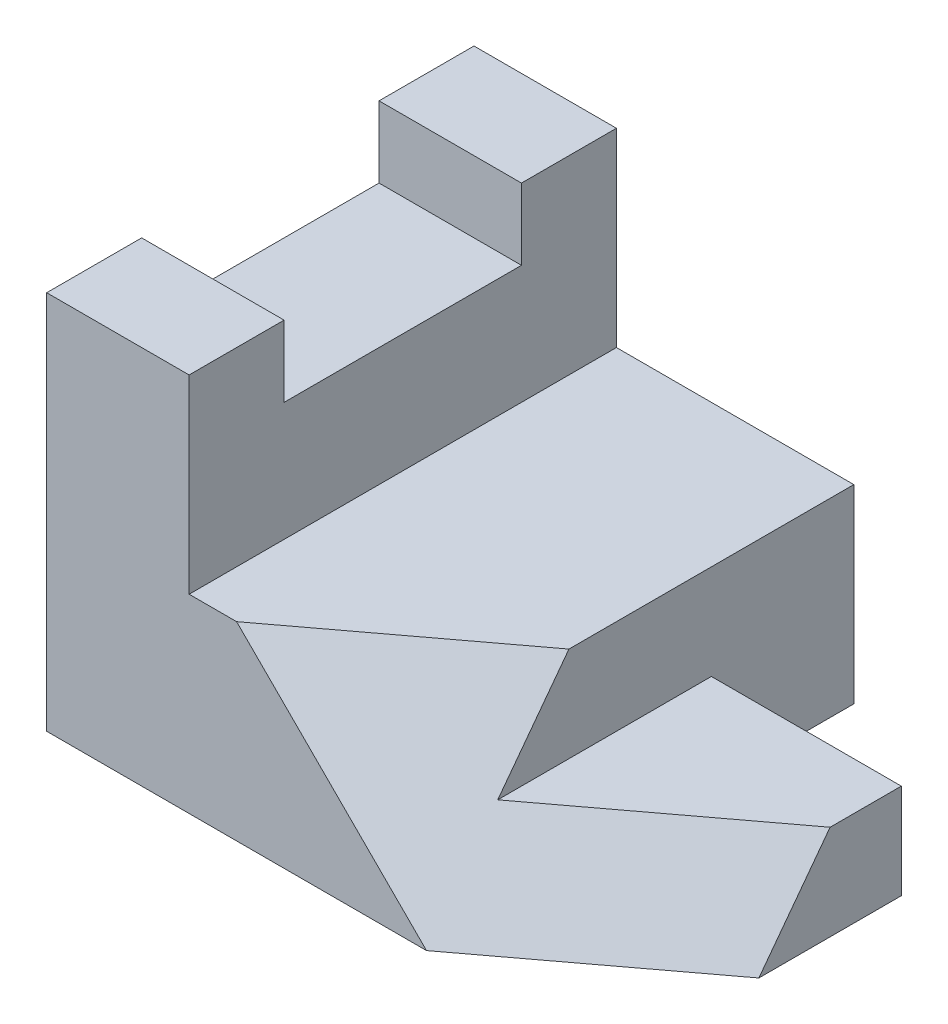
ISO-10303-21;
HEADER;
FILE_DESCRIPTION(('STEP AP214'),'2;1');
FILE_NAME('part.step','',(''),(''),'','','');
FILE_SCHEMA(('AUTOMOTIVE_DESIGN { 1 0 10303 214 1 1 1 1 }'));
ENDSEC;
DATA;
#1=APPLICATION_CONTEXT('core data for automotive mechanical design processes');
#2=APPLICATION_PROTOCOL_DEFINITION('international standard','automotive_design',2000,#1);
#3=PRODUCT_CONTEXT('',#1,'mechanical');
#4=PRODUCT('Part','Part','',(#3));
#5=PRODUCT_RELATED_PRODUCT_CATEGORY('part','',(#4));
#6=PRODUCT_DEFINITION_FORMATION('','',#4);
#7=PRODUCT_DEFINITION_CONTEXT('part definition',#1,'design');
#8=PRODUCT_DEFINITION('design','',#6,#7);
#9=PRODUCT_DEFINITION_SHAPE('','',#8);
#10=(LENGTH_UNIT() NAMED_UNIT(*) SI_UNIT(.MILLI.,.METRE.));
#11=(NAMED_UNIT(*) PLANE_ANGLE_UNIT() SI_UNIT($,.RADIAN.));
#12=(NAMED_UNIT(*) SI_UNIT($,.STERADIAN.) SOLID_ANGLE_UNIT());
#13=UNCERTAINTY_MEASURE_WITH_UNIT(LENGTH_MEASURE(1.E-05),#10,'distance_accuracy_value','');
#14=(GEOMETRIC_REPRESENTATION_CONTEXT(3) GLOBAL_UNCERTAINTY_ASSIGNED_CONTEXT((#13)) GLOBAL_UNIT_ASSIGNED_CONTEXT((#10,
#11,#12)) REPRESENTATION_CONTEXT('',''));
#15=CARTESIAN_POINT('',(0.,0.,0.));
#16=DIRECTION('',(0.,0.,1.));
#17=DIRECTION('',(1.,0.,0.));
#18=AXIS2_PLACEMENT_3D('',#15,#16,#17);
#19=CARTESIAN_POINT('',(0.,0.,0.));
#20=DIRECTION('',(-1.,0.,0.));
#21=DIRECTION('',(0.,0.,1.));
#22=AXIS2_PLACEMENT_3D('',#19,#20,#21);
#23=PLANE('',#22);
#24=DIRECTION('',(0.,0.,-1.));
#25=VECTOR('',#24,1.);
#26=CARTESIAN_POINT('',(0.,12.7,19.05));
#27=LINE('',#26,#25);
#28=CARTESIAN_POINT('',(0.,12.7,28.575));
#29=VERTEX_POINT('',#28);
#30=CARTESIAN_POINT('',(0.,12.7,19.05));
#31=VERTEX_POINT('',#30);
#32=EDGE_CURVE('E132',#29,#31,#27,.T.);
#33=ORIENTED_EDGE('',*,*,#32,.F.);
#34=DIRECTION('',(0.,0.8,-0.6));
#35=VECTOR('',#34,1.);
#36=CARTESIAN_POINT('',(0.,18.288,24.384));
#37=LINE('',#36,#35);
#38=CARTESIAN_POINT('',(0.,0.,38.1));
#39=VERTEX_POINT('',#38);
#40=EDGE_CURVE('E178',#39,#29,#37,.T.);
#41=ORIENTED_EDGE('',*,*,#40,.F.);
#42=DIRECTION('',(0.,0.,-1.));
#43=VECTOR('',#42,1.);
#44=CARTESIAN_POINT('',(0.,0.,57.15));
#45=LINE('',#44,#43);
#46=CARTESIAN_POINT('',(0.,0.,19.05));
#47=VERTEX_POINT('',#46);
#48=EDGE_CURVE('E151',#39,#47,#45,.T.);
#49=ORIENTED_EDGE('',*,*,#48,.T.);
#50=DIRECTION('',(0.,1.,0.));
#51=VECTOR('',#50,1.);
#52=CARTESIAN_POINT('',(0.,0.,19.05));
#53=LINE('',#52,#51);
#54=EDGE_CURVE('E145',#47,#31,#53,.T.);
#55=ORIENTED_EDGE('',*,*,#54,.T.);
#56=EDGE_LOOP('',(#33,#41,#49,#55));
#57=FACE_BOUND('',#56,.T.);
#58=ADVANCED_FACE('F33',(#57),#23,.F.);
#59=CARTESIAN_POINT('',(0.,0.,19.05));
#60=DIRECTION('',(0.,0.,1.));
#61=DIRECTION('',(1.,0.,0.));
#62=AXIS2_PLACEMENT_3D('',#59,#60,#61);
#63=PLANE('',#62);
#64=DIRECTION('',(-1.,0.,0.));
#65=VECTOR('',#64,1.);
#66=CARTESIAN_POINT('',(-25.4,12.7,19.05));
#67=LINE('',#66,#65);
#68=CARTESIAN_POINT('',(-25.4,12.7,19.05));
#69=VERTEX_POINT('',#68);
#70=EDGE_CURVE('E135',#31,#69,#67,.T.);
#71=ORIENTED_EDGE('',*,*,#70,.F.);
#72=ORIENTED_EDGE('',*,*,#54,.F.);
#73=DIRECTION('',(1.,0.,0.));
#74=VECTOR('',#73,1.);
#75=CARTESIAN_POINT('',(0.,0.,19.05));
#76=LINE('',#75,#74);
#77=CARTESIAN_POINT('',(-25.4,0.,19.05));
#78=VERTEX_POINT('',#77);
#79=EDGE_CURVE('E162',#78,#47,#76,.T.);
#80=ORIENTED_EDGE('',*,*,#79,.F.);
#81=DIRECTION('',(0.,1.,0.));
#82=VECTOR('',#81,1.);
#83=CARTESIAN_POINT('',(-25.4,0.,19.05));
#84=LINE('',#83,#82);
#85=EDGE_CURVE('E147',#78,#69,#84,.T.);
#86=ORIENTED_EDGE('',*,*,#85,.T.);
#87=EDGE_LOOP('',(#71,#72,#80,#86));
#88=FACE_BOUND('',#87,.T.);
#89=ADVANCED_FACE('F143',(#88),#63,.F.);
#90=CARTESIAN_POINT('',(-57.15,0.,57.15));
#91=DIRECTION('',(0.,0.,1.));
#92=DIRECTION('',(1.,0.,0.));
#93=AXIS2_PLACEMENT_3D('',#90,#91,#92);
#94=PLANE('',#93);
#95=DIRECTION('',(1.,0.,0.));
#96=VECTOR('',#95,1.);
#97=CARTESIAN_POINT('',(-57.15,0.,57.15));
#98=LINE('',#97,#96);
#99=CARTESIAN_POINT('',(-76.2,0.,57.15));
#100=VERTEX_POINT('',#99);
#101=CARTESIAN_POINT('',(-25.4,0.,57.15));
#102=VERTEX_POINT('',#101);
#103=EDGE_CURVE('E169',#100,#102,#98,.T.);
#104=ORIENTED_EDGE('',*,*,#103,.T.);
#105=DIRECTION('',(-0.707106781186548,0.707106781186548,0.));
#106=VECTOR('',#105,1.);
#107=CARTESIAN_POINT('',(-12.7,-12.7,57.15));
#108=LINE('',#107,#106);
#109=CARTESIAN_POINT('',(-50.8,25.4,57.15));
#110=VERTEX_POINT('',#109);
#111=EDGE_CURVE('E222',#102,#110,#108,.T.);
#112=ORIENTED_EDGE('',*,*,#111,.T.);
#113=DIRECTION('',(1.,0.,0.));
#114=VECTOR('',#113,1.);
#115=CARTESIAN_POINT('',(-57.15,25.4,57.15));
#116=LINE('',#115,#114);
#117=CARTESIAN_POINT('',(-57.15,25.4,57.15));
#118=VERTEX_POINT('',#117);
#119=EDGE_CURVE('E175',#118,#110,#116,.T.);
#120=ORIENTED_EDGE('',*,*,#119,.F.);
#121=DIRECTION('',(0.,1.,0.));
#122=VECTOR('',#121,1.);
#123=CARTESIAN_POINT('',(-57.15,0.,57.15));
#124=LINE('',#123,#122);
#125=CARTESIAN_POINT('',(-57.15,50.8,57.15));
#126=VERTEX_POINT('',#125);
#127=EDGE_CURVE('E148',#118,#126,#124,.T.);
#128=ORIENTED_EDGE('',*,*,#127,.T.);
#129=DIRECTION('',(1.,0.,0.));
#130=VECTOR('',#129,1.);
#131=CARTESIAN_POINT('',(-76.2,50.8,57.15));
#132=LINE('',#131,#130);
#133=CARTESIAN_POINT('',(-76.2,50.8,57.15));
#134=VERTEX_POINT('',#133);
#135=EDGE_CURVE('E225',#134,#126,#132,.T.);
#136=ORIENTED_EDGE('',*,*,#135,.F.);
#137=DIRECTION('',(0.,1.,0.));
#138=VECTOR('',#137,1.);
#139=CARTESIAN_POINT('',(-76.2,0.,57.15));
#140=LINE('',#139,#138);
#141=EDGE_CURVE('E233',#100,#134,#140,.T.);
#142=ORIENTED_EDGE('',*,*,#141,.F.);
#143=EDGE_LOOP('',(#104,#112,#120,#128,#136,#142));
#144=FACE_BOUND('',#143,.T.);
#145=ADVANCED_FACE('F35',(#144),#94,.T.);
#146=CARTESIAN_POINT('',(-57.15,25.4,57.15));
#147=DIRECTION('',(0.,1.,0.));
#148=DIRECTION('',(0.,0.,1.));
#149=AXIS2_PLACEMENT_3D('',#146,#147,#148);
#150=PLANE('',#149);
#151=DIRECTION('',(-0.8,0.,0.6));
#152=VECTOR('',#151,1.);
#153=CARTESIAN_POINT('',(9.14400000000001,25.4,12.192));
#154=LINE('',#153,#152);
#155=CARTESIAN_POINT('',(-25.4,25.4,38.1));
#156=VERTEX_POINT('',#155);
#157=EDGE_CURVE('E226',#156,#110,#154,.T.);
#158=ORIENTED_EDGE('',*,*,#157,.F.);
#159=DIRECTION('',(0.,0.,1.));
#160=VECTOR('',#159,1.);
#161=CARTESIAN_POINT('',(-25.4,25.4,0.));
#162=LINE('',#161,#160);
#163=CARTESIAN_POINT('',(-25.4,25.4,0.));
#164=VERTEX_POINT('',#163);
#165=EDGE_CURVE('E158',#164,#156,#162,.T.);
#166=ORIENTED_EDGE('',*,*,#165,.F.);
#167=DIRECTION('',(1.,0.,0.));
#168=VECTOR('',#167,1.);
#169=CARTESIAN_POINT('',(-57.15,25.4,0.));
#170=LINE('',#169,#168);
#171=CARTESIAN_POINT('',(-57.15,25.4,0.));
#172=VERTEX_POINT('',#171);
#173=EDGE_CURVE('E172',#172,#164,#170,.T.);
#174=ORIENTED_EDGE('',*,*,#173,.F.);
#175=DIRECTION('',(0.,0.,1.));
#176=VECTOR('',#175,1.);
#177=CARTESIAN_POINT('',(-57.15,25.4,57.15));
#178=LINE('',#177,#176);
#179=EDGE_CURVE('E153',#172,#118,#178,.T.);
#180=ORIENTED_EDGE('',*,*,#179,.T.);
#181=ORIENTED_EDGE('',*,*,#119,.T.);
#182=EDGE_LOOP('',(#158,#166,#174,#180,#181));
#183=FACE_BOUND('',#182,.T.);
#184=ADVANCED_FACE('F308',(#183),#150,.T.);
#185=CARTESIAN_POINT('',(-57.15,0.,57.15));
#186=DIRECTION('',(0.,-1.,0.));
#187=DIRECTION('',(0.,0.,-1.));
#188=AXIS2_PLACEMENT_3D('',#185,#186,#187);
#189=PLANE('',#188);
#190=ORIENTED_EDGE('',*,*,#48,.F.);
#191=DIRECTION('',(-0.8,0.,0.6));
#192=VECTOR('',#191,1.);
#193=CARTESIAN_POINT('',(34.544,0.,12.192));
#194=LINE('',#193,#192);
#195=EDGE_CURVE('E55',#39,#102,#194,.T.);
#196=ORIENTED_EDGE('',*,*,#195,.T.);
#197=ORIENTED_EDGE('',*,*,#103,.F.);
#198=DIRECTION('',(0.,0.,1.));
#199=VECTOR('',#198,1.);
#200=CARTESIAN_POINT('',(-76.2,0.,0.));
#201=LINE('',#200,#199);
#202=CARTESIAN_POINT('',(-76.2,0.,0.));
#203=VERTEX_POINT('',#202);
#204=EDGE_CURVE('E191',#203,#100,#201,.T.);
#205=ORIENTED_EDGE('',*,*,#204,.F.);
#206=DIRECTION('',(1.,0.,0.));
#207=VECTOR('',#206,1.);
#208=CARTESIAN_POINT('',(-57.15,0.,0.));
#209=LINE('',#208,#207);
#210=CARTESIAN_POINT('',(-25.4,0.,0.));
#211=VERTEX_POINT('',#210);
#212=EDGE_CURVE('E176',#203,#211,#209,.T.);
#213=ORIENTED_EDGE('',*,*,#212,.T.);
#214=DIRECTION('',(0.,0.,1.));
#215=VECTOR('',#214,1.);
#216=CARTESIAN_POINT('',(-25.4,0.,0.));
#217=LINE('',#216,#215);
#218=EDGE_CURVE('E189',#211,#78,#217,.T.);
#219=ORIENTED_EDGE('',*,*,#218,.T.);
#220=ORIENTED_EDGE('',*,*,#79,.T.);
#221=EDGE_LOOP('',(#190,#196,#197,#205,#213,#219,#220));
#222=FACE_BOUND('',#221,.T.);
#223=ADVANCED_FACE('F188',(#222),#189,.T.);
#224=CARTESIAN_POINT('',(-57.15,0.,0.));
#225=DIRECTION('',(0.,0.,-1.));
#226=DIRECTION('',(-1.,0.,0.));
#227=AXIS2_PLACEMENT_3D('',#224,#225,#226);
#228=PLANE('',#227);
#229=DIRECTION('',(0.,1.,0.));
#230=VECTOR('',#229,1.);
#231=CARTESIAN_POINT('',(-25.4,0.,0.));
#232=LINE('',#231,#230);
#233=EDGE_CURVE('E155',#211,#164,#232,.T.);
#234=ORIENTED_EDGE('',*,*,#233,.F.);
#235=ORIENTED_EDGE('',*,*,#212,.F.);
#236=DIRECTION('',(0.,-1.,0.));
#237=VECTOR('',#236,1.);
#238=CARTESIAN_POINT('',(-76.2,0.,0.));
#239=LINE('',#238,#237);
#240=CARTESIAN_POINT('',(-76.2,50.8,0.));
#241=VERTEX_POINT('',#240);
#242=EDGE_CURVE('E198',#241,#203,#239,.T.);
#243=ORIENTED_EDGE('',*,*,#242,.F.);
#244=DIRECTION('',(1.,0.,0.));
#245=VECTOR('',#244,1.);
#246=CARTESIAN_POINT('',(-76.2,50.8,0.));
#247=LINE('',#246,#245);
#248=CARTESIAN_POINT('',(-57.15,50.8,0.));
#249=VERTEX_POINT('',#248);
#250=EDGE_CURVE('E204',#241,#249,#247,.T.);
#251=ORIENTED_EDGE('',*,*,#250,.T.);
#252=DIRECTION('',(0.,-1.,0.));
#253=VECTOR('',#252,1.);
#254=CARTESIAN_POINT('',(-57.15,0.,0.));
#255=LINE('',#254,#253);
#256=EDGE_CURVE('E219',#249,#172,#255,.T.);
#257=ORIENTED_EDGE('',*,*,#256,.T.);
#258=ORIENTED_EDGE('',*,*,#173,.T.);
#259=EDGE_LOOP('',(#234,#235,#243,#251,#257,#258));
#260=FACE_BOUND('',#259,.T.);
#261=ADVANCED_FACE('F196',(#260),#228,.T.);
#262=CARTESIAN_POINT('',(-25.4,0.,0.));
#263=DIRECTION('',(-1.,0.,0.));
#264=DIRECTION('',(0.,0.,1.));
#265=AXIS2_PLACEMENT_3D('',#262,#263,#264);
#266=PLANE('',#265);
#267=ORIENTED_EDGE('',*,*,#165,.T.);
#268=DIRECTION('',(0.,-0.8,0.6));
#269=VECTOR('',#268,1.);
#270=CARTESIAN_POINT('',(-25.4,13.45184,47.06112));
#271=LINE('',#270,#269);
#272=CARTESIAN_POINT('',(-25.4,12.7,47.625));
#273=VERTEX_POINT('',#272);
#274=EDGE_CURVE('E11',#156,#273,#271,.T.);
#275=ORIENTED_EDGE('',*,*,#274,.T.);
#276=DIRECTION('',(0.,0.,1.));
#277=VECTOR('',#276,1.);
#278=CARTESIAN_POINT('',(-25.4,12.7,19.05));
#279=LINE('',#278,#277);
#280=EDGE_CURVE('E48',#69,#273,#279,.T.);
#281=ORIENTED_EDGE('',*,*,#280,.F.);
#282=ORIENTED_EDGE('',*,*,#85,.F.);
#283=ORIENTED_EDGE('',*,*,#218,.F.);
#284=ORIENTED_EDGE('',*,*,#233,.T.);
#285=EDGE_LOOP('',(#267,#275,#281,#282,#283,#284));
#286=FACE_BOUND('',#285,.T.);
#287=ADVANCED_FACE('F307',(#286),#266,.F.);
#288=CARTESIAN_POINT('',(47.244,-12.7,12.192));
#289=DIRECTION('',(0.514495755427526,0.514495755427526,0.685994340570035));
#290=DIRECTION('',(0.8,0.,-0.6));
#291=AXIS2_PLACEMENT_3D('',#288,#289,#290);
#292=PLANE('',#291);
#293=ORIENTED_EDGE('',*,*,#274,.F.);
#294=ORIENTED_EDGE('',*,*,#157,.T.);
#295=ORIENTED_EDGE('',*,*,#111,.F.);
#296=ORIENTED_EDGE('',*,*,#195,.F.);
#297=ORIENTED_EDGE('',*,*,#40,.T.);
#298=DIRECTION('',(-0.8,0.,0.6));
#299=VECTOR('',#298,1.);
#300=CARTESIAN_POINT('',(38.1,12.7,0.));
#301=LINE('',#300,#299);
#302=EDGE_CURVE('E41',#29,#273,#301,.T.);
#303=ORIENTED_EDGE('',*,*,#302,.T.);
#304=EDGE_LOOP('',(#293,#294,#295,#296,#297,#303));
#305=FACE_BOUND('',#304,.T.);
#306=ADVANCED_FACE('F297',(#305),#292,.T.);
#307=CARTESIAN_POINT('',(-76.2,50.8,57.15));
#308=DIRECTION('',(0.,-1.,0.));
#309=DIRECTION('',(0.,0.,-1.));
#310=AXIS2_PLACEMENT_3D('',#307,#308,#309);
#311=PLANE('',#310);
#312=DIRECTION('',(0.,0.,-1.));
#313=VECTOR('',#312,1.);
#314=CARTESIAN_POINT('',(-57.15,50.8,57.15));
#315=LINE('',#314,#313);
#316=CARTESIAN_POINT('',(-57.15,50.8,44.45));
#317=VERTEX_POINT('',#316);
#318=EDGE_CURVE('E214',#126,#317,#315,.T.);
#319=ORIENTED_EDGE('',*,*,#318,.T.);
#320=DIRECTION('',(1.,0.,0.));
#321=VECTOR('',#320,1.);
#322=CARTESIAN_POINT('',(-76.2,50.8,44.45));
#323=LINE('',#322,#321);
#324=CARTESIAN_POINT('',(-76.2,50.8,44.45));
#325=VERTEX_POINT('',#324);
#326=EDGE_CURVE('E275',#325,#317,#323,.T.);
#327=ORIENTED_EDGE('',*,*,#326,.F.);
#328=DIRECTION('',(0.,0.,-1.));
#329=VECTOR('',#328,1.);
#330=CARTESIAN_POINT('',(-76.2,50.8,57.15));
#331=LINE('',#330,#329);
#332=EDGE_CURVE('E236',#134,#325,#331,.T.);
#333=ORIENTED_EDGE('',*,*,#332,.F.);
#334=ORIENTED_EDGE('',*,*,#135,.T.);
#335=EDGE_LOOP('',(#319,#327,#333,#334));
#336=FACE_BOUND('',#335,.T.);
#337=ADVANCED_FACE('F279',(#336),#311,.F.);
#338=CARTESIAN_POINT('',(-76.2,50.8,44.45));
#339=DIRECTION('',(0.,0.,1.));
#340=DIRECTION('',(0.,-1.,0.));
#341=AXIS2_PLACEMENT_3D('',#338,#339,#340);
#342=PLANE('',#341);
#343=DIRECTION('',(0.,-1.,0.));
#344=VECTOR('',#343,1.);
#345=CARTESIAN_POINT('',(-57.15,50.8,44.45));
#346=LINE('',#345,#344);
#347=CARTESIAN_POINT('',(-57.15,41.275,44.45));
#348=VERTEX_POINT('',#347);
#349=EDGE_CURVE('E283',#317,#348,#346,.T.);
#350=ORIENTED_EDGE('',*,*,#349,.T.);
#351=DIRECTION('',(1.,0.,0.));
#352=VECTOR('',#351,1.);
#353=CARTESIAN_POINT('',(-76.2,41.275,44.45));
#354=LINE('',#353,#352);
#355=CARTESIAN_POINT('',(-76.2,41.275,44.45));
#356=VERTEX_POINT('',#355);
#357=EDGE_CURVE('E272',#356,#348,#354,.T.);
#358=ORIENTED_EDGE('',*,*,#357,.F.);
#359=DIRECTION('',(0.,-1.,0.));
#360=VECTOR('',#359,1.);
#361=CARTESIAN_POINT('',(-76.2,50.8,44.45));
#362=LINE('',#361,#360);
#363=EDGE_CURVE('E238',#325,#356,#362,.T.);
#364=ORIENTED_EDGE('',*,*,#363,.F.);
#365=ORIENTED_EDGE('',*,*,#326,.T.);
#366=EDGE_LOOP('',(#350,#358,#364,#365));
#367=FACE_BOUND('',#366,.T.);
#368=ADVANCED_FACE('F289',(#367),#342,.F.);
#369=CARTESIAN_POINT('',(-76.2,41.275,12.7));
#370=DIRECTION('',(0.,-1.,0.));
#371=DIRECTION('',(0.,0.,-1.));
#372=AXIS2_PLACEMENT_3D('',#369,#370,#371);
#373=PLANE('',#372);
#374=DIRECTION('',(0.,0.,-1.));
#375=VECTOR('',#374,1.);
#376=CARTESIAN_POINT('',(-57.15,41.275,12.7));
#377=LINE('',#376,#375);
#378=CARTESIAN_POINT('',(-57.15,41.275,12.7));
#379=VERTEX_POINT('',#378);
#380=EDGE_CURVE('E266',#348,#379,#377,.T.);
#381=ORIENTED_EDGE('',*,*,#380,.T.);
#382=DIRECTION('',(1.,0.,0.));
#383=VECTOR('',#382,1.);
#384=CARTESIAN_POINT('',(-76.2,41.275,12.7));
#385=LINE('',#384,#383);
#386=CARTESIAN_POINT('',(-76.2,41.275,12.7));
#387=VERTEX_POINT('',#386);
#388=EDGE_CURVE('E256',#387,#379,#385,.T.);
#389=ORIENTED_EDGE('',*,*,#388,.F.);
#390=DIRECTION('',(0.,0.,-1.));
#391=VECTOR('',#390,1.);
#392=CARTESIAN_POINT('',(-76.2,41.275,12.7));
#393=LINE('',#392,#391);
#394=EDGE_CURVE('E243',#356,#387,#393,.T.);
#395=ORIENTED_EDGE('',*,*,#394,.F.);
#396=ORIENTED_EDGE('',*,*,#357,.T.);
#397=EDGE_LOOP('',(#381,#389,#395,#396));
#398=FACE_BOUND('',#397,.T.);
#399=ADVANCED_FACE('F287',(#398),#373,.F.);
#400=CARTESIAN_POINT('',(-76.2,50.8,12.7));
#401=DIRECTION('',(0.,0.,-1.));
#402=DIRECTION('',(0.,1.,0.));
#403=AXIS2_PLACEMENT_3D('',#400,#401,#402);
#404=PLANE('',#403);
#405=DIRECTION('',(0.,1.,0.));
#406=VECTOR('',#405,1.);
#407=CARTESIAN_POINT('',(-57.15,50.8,12.7));
#408=LINE('',#407,#406);
#409=CARTESIAN_POINT('',(-57.15,50.8,12.7));
#410=VERTEX_POINT('',#409);
#411=EDGE_CURVE('E253',#379,#410,#408,.T.);
#412=ORIENTED_EDGE('',*,*,#411,.T.);
#413=DIRECTION('',(1.,0.,0.));
#414=VECTOR('',#413,1.);
#415=CARTESIAN_POINT('',(-76.2,50.8,12.7));
#416=LINE('',#415,#414);
#417=CARTESIAN_POINT('',(-76.2,50.8,12.7));
#418=VERTEX_POINT('',#417);
#419=EDGE_CURVE('E206',#418,#410,#416,.T.);
#420=ORIENTED_EDGE('',*,*,#419,.F.);
#421=DIRECTION('',(0.,1.,0.));
#422=VECTOR('',#421,1.);
#423=CARTESIAN_POINT('',(-76.2,50.8,12.7));
#424=LINE('',#423,#422);
#425=EDGE_CURVE('E208',#387,#418,#424,.T.);
#426=ORIENTED_EDGE('',*,*,#425,.F.);
#427=ORIENTED_EDGE('',*,*,#388,.T.);
#428=EDGE_LOOP('',(#412,#420,#426,#427));
#429=FACE_BOUND('',#428,.T.);
#430=ADVANCED_FACE('F251',(#429),#404,.F.);
#431=CARTESIAN_POINT('',(-76.2,50.8,0.));
#432=DIRECTION('',(0.,-1.,0.));
#433=DIRECTION('',(0.,0.,-1.));
#434=AXIS2_PLACEMENT_3D('',#431,#432,#433);
#435=PLANE('',#434);
#436=DIRECTION('',(0.,0.,-1.));
#437=VECTOR('',#436,1.);
#438=CARTESIAN_POINT('',(-57.15,50.8,0.));
#439=LINE('',#438,#437);
#440=EDGE_CURVE('E259',#410,#249,#439,.T.);
#441=ORIENTED_EDGE('',*,*,#440,.T.);
#442=ORIENTED_EDGE('',*,*,#250,.F.);
#443=DIRECTION('',(0.,0.,-1.));
#444=VECTOR('',#443,1.);
#445=CARTESIAN_POINT('',(-76.2,50.8,0.));
#446=LINE('',#445,#444);
#447=EDGE_CURVE('E202',#418,#241,#446,.T.);
#448=ORIENTED_EDGE('',*,*,#447,.F.);
#449=ORIENTED_EDGE('',*,*,#419,.T.);
#450=EDGE_LOOP('',(#441,#442,#448,#449));
#451=FACE_BOUND('',#450,.T.);
#452=ADVANCED_FACE('F258',(#451),#435,.F.);
#453=CARTESIAN_POINT('',(-76.2,0.,0.));
#454=DIRECTION('',(-1.,0.,0.));
#455=DIRECTION('',(0.,0.,1.));
#456=AXIS2_PLACEMENT_3D('',#453,#454,#455);
#457=PLANE('',#456);
#458=ORIENTED_EDGE('',*,*,#204,.T.);
#459=ORIENTED_EDGE('',*,*,#141,.T.);
#460=ORIENTED_EDGE('',*,*,#332,.T.);
#461=ORIENTED_EDGE('',*,*,#363,.T.);
#462=ORIENTED_EDGE('',*,*,#394,.T.);
#463=ORIENTED_EDGE('',*,*,#425,.T.);
#464=ORIENTED_EDGE('',*,*,#447,.T.);
#465=ORIENTED_EDGE('',*,*,#242,.T.);
#466=EDGE_LOOP('',(#458,#459,#460,#461,#462,#463,#464,#465));
#467=FACE_BOUND('',#466,.T.);
#468=ADVANCED_FACE('F200',(#467),#457,.T.);
#469=CARTESIAN_POINT('',(-57.15,0.,0.));
#470=DIRECTION('',(-1.,0.,0.));
#471=DIRECTION('',(0.,0.,1.));
#472=AXIS2_PLACEMENT_3D('',#469,#470,#471);
#473=PLANE('',#472);
#474=ORIENTED_EDGE('',*,*,#179,.F.);
#475=ORIENTED_EDGE('',*,*,#256,.F.);
#476=ORIENTED_EDGE('',*,*,#440,.F.);
#477=ORIENTED_EDGE('',*,*,#411,.F.);
#478=ORIENTED_EDGE('',*,*,#380,.F.);
#479=ORIENTED_EDGE('',*,*,#349,.F.);
#480=ORIENTED_EDGE('',*,*,#318,.F.);
#481=ORIENTED_EDGE('',*,*,#127,.F.);
#482=EDGE_LOOP('',(#474,#475,#476,#477,#478,#479,#480,#481));
#483=FACE_BOUND('',#482,.T.);
#484=ADVANCED_FACE('F264',(#483),#473,.F.);
#485=CARTESIAN_POINT('',(0.,12.7,0.));
#486=DIRECTION('',(0.,1.,0.));
#487=DIRECTION('',(0.,0.,1.));
#488=AXIS2_PLACEMENT_3D('',#485,#486,#487);
#489=PLANE('',#488);
#490=ORIENTED_EDGE('',*,*,#32,.T.);
#491=ORIENTED_EDGE('',*,*,#70,.T.);
#492=ORIENTED_EDGE('',*,*,#280,.T.);
#493=ORIENTED_EDGE('',*,*,#302,.F.);
#494=EDGE_LOOP('',(#490,#491,#492,#493));
#495=FACE_BOUND('',#494,.T.);
#496=ADVANCED_FACE('F134',(#495),#489,.T.);
#497=CLOSED_SHELL('',(#58,#89,#145,#184,#223,#261,#287,#306,#337,#368,#399,#430,#452,#468,#484,#496));
#498=MANIFOLD_SOLID_BREP('B2',#497);
#499=ADVANCED_BREP_SHAPE_REPRESENTATION('',(#18,#498),#14);
#500=SHAPE_DEFINITION_REPRESENTATION(#9,#499);
ENDSEC;
END-ISO-10303-21;
